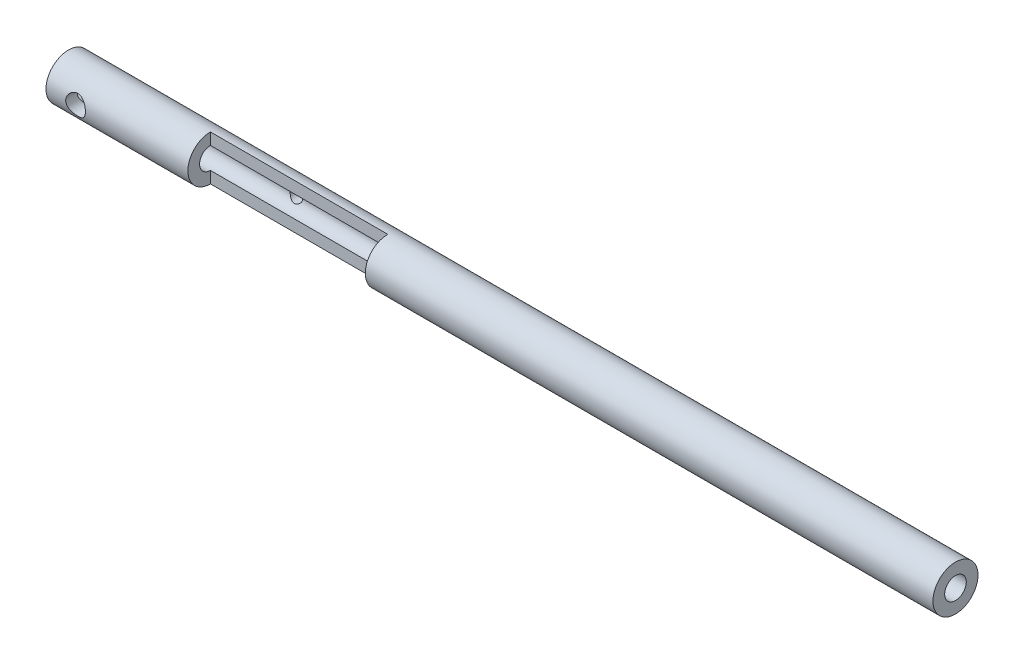
ISO-10303-21;
HEADER;
FILE_DESCRIPTION(('STEP AP214'),'2;1');
FILE_NAME('part.step','',(''),(''),'','','');
FILE_SCHEMA(('AUTOMOTIVE_DESIGN { 1 0 10303 214 1 1 1 1 }'));
ENDSEC;
DATA;
#1=APPLICATION_CONTEXT('core data for automotive mechanical design processes');
#2=APPLICATION_PROTOCOL_DEFINITION('international standard','automotive_design',2000,#1);
#3=PRODUCT_CONTEXT('',#1,'mechanical');
#4=PRODUCT('Part','Part','',(#3));
#5=PRODUCT_RELATED_PRODUCT_CATEGORY('part','',(#4));
#6=PRODUCT_DEFINITION_FORMATION('','',#4);
#7=PRODUCT_DEFINITION_CONTEXT('part definition',#1,'design');
#8=PRODUCT_DEFINITION('design','',#6,#7);
#9=PRODUCT_DEFINITION_SHAPE('','',#8);
#10=(LENGTH_UNIT() NAMED_UNIT(*) SI_UNIT(.MILLI.,.METRE.));
#11=(NAMED_UNIT(*) PLANE_ANGLE_UNIT() SI_UNIT($,.RADIAN.));
#12=(NAMED_UNIT(*) SI_UNIT($,.STERADIAN.) SOLID_ANGLE_UNIT());
#13=UNCERTAINTY_MEASURE_WITH_UNIT(LENGTH_MEASURE(1.E-05),#10,'distance_accuracy_value','');
#14=(GEOMETRIC_REPRESENTATION_CONTEXT(3) GLOBAL_UNCERTAINTY_ASSIGNED_CONTEXT((#13)) GLOBAL_UNIT_ASSIGNED_CONTEXT((#10,
#11,#12)) REPRESENTATION_CONTEXT('',''));
#15=CARTESIAN_POINT('',(0.,0.,0.));
#16=DIRECTION('',(0.,0.,1.));
#17=DIRECTION('',(1.,0.,0.));
#18=AXIS2_PLACEMENT_3D('',#15,#16,#17);
#19=CARTESIAN_POINT('',(125.,0.,0.));
#20=DIRECTION('',(-1.,0.,0.));
#21=DIRECTION('',(0.,0.,1.));
#22=AXIS2_PLACEMENT_3D('',#19,#20,#21);
#23=CYLINDRICAL_SURFACE('',#22,3.175);
#24=CARTESIAN_POINT('',(2.78232389778931,0.,-3.175));
#25=CARTESIAN_POINT('',(2.78233266098721,0.0741002484227452,-3.17499328883161));
#26=CARTESIAN_POINT('',(2.78828642108586,0.148299472937965,-3.17237652187415));
#27=CARTESIAN_POINT('',(2.8118815369405,0.294580240186064,-3.1621603753961));
#28=CARTESIAN_POINT('',(2.82955160528198,0.366656125008927,-3.15454875570767));
#29=CARTESIAN_POINT('',(2.87578784578092,0.506328771138021,-3.13515691619847));
#30=CARTESIAN_POINT('',(2.90431561423495,0.573940344797195,-3.12339139921422));
#31=CARTESIAN_POINT('',(2.97129046653546,0.703346557839349,-3.09682066833734));
#32=CARTESIAN_POINT('',(3.00973510520735,0.76514262601601,-3.08201620393286));
#33=CARTESIAN_POINT('',(3.09764726133812,0.884618048481286,-3.04993281462929));
#34=CARTESIAN_POINT('',(3.14756680396537,0.941941369798854,-3.03256759593424));
#35=CARTESIAN_POINT('',(3.25605315321597,1.04771445081247,-2.99767035314381));
#36=CARTESIAN_POINT('',(3.31462492362141,1.09615908081792,-2.98013823873808));
#37=CARTESIAN_POINT('',(3.44268795149438,1.18546917443488,-2.94579456146462));
#38=CARTESIAN_POINT('',(3.51260505200963,1.22576410582405,-2.92907712978244));
#39=CARTESIAN_POINT('',(3.65905742686315,1.29386286269278,-2.89964313526043));
#40=CARTESIAN_POINT('',(3.73558892060919,1.32167376809972,-2.88692430596705));
#41=CARTESIAN_POINT('',(3.88900181474608,1.36250712592522,-2.86787140706193));
#42=CARTESIAN_POINT('',(3.9656617684621,1.37621806751729,-2.86124198120225));
#43=CARTESIAN_POINT('',(4.12045855027018,1.39060507514491,-2.85427983996626));
#44=CARTESIAN_POINT('',(4.19859440581006,1.39128944442941,-2.85394311357181));
#45=CARTESIAN_POINT('',(4.3469224025084,1.38011859622184,-2.85935712378885));
#46=CARTESIAN_POINT('',(4.41721864390722,1.36933935010344,-2.86458555314038));
#47=CARTESIAN_POINT('',(4.55488047825007,1.33736609275169,-2.87965031057459));
#48=CARTESIAN_POINT('',(4.62224543507238,1.31616983305809,-2.88948763344246));
#49=CARTESIAN_POINT('',(4.75391716957307,1.26354472472517,-2.91288885801366));
#50=CARTESIAN_POINT('',(4.81812287650434,1.23189919119503,-2.92653063013318));
#51=CARTESIAN_POINT('',(4.94057887593984,1.15942892451342,-2.95599007454227));
#52=CARTESIAN_POINT('',(4.99882668180698,1.11860038122587,-2.97180864895153));
#53=CARTESIAN_POINT('',(5.11348504064289,1.02441856648982,-3.00564809683438));
#54=CARTESIAN_POINT('',(5.16920655034242,0.97024810174605,-3.02373611289301));
#55=CARTESIAN_POINT('',(5.27101907866217,0.853172341185042,-3.05883224988505));
#56=CARTESIAN_POINT('',(5.31710735844691,0.790264569691992,-3.07584006275039));
#57=CARTESIAN_POINT('',(5.39950116016502,0.65522148123829,-3.10744978102215));
#58=CARTESIAN_POINT('',(5.43549865938014,0.582878050567121,-3.12197153756001));
#59=CARTESIAN_POINT('',(5.49456556251154,0.432363635808159,-3.14634437170121));
#60=CARTESIAN_POINT('',(5.51764286446223,0.354196245059698,-3.15619830214864));
#61=CARTESIAN_POINT('',(5.54870802870136,0.199986690739896,-3.16957523029787));
#62=CARTESIAN_POINT('',(5.55761887301343,0.124164035325146,-3.17348467421653));
#63=CARTESIAN_POINT('',(5.56288408013387,-0.0279890567748323,-3.17578696731654));
#64=CARTESIAN_POINT('',(5.55924253564506,-0.104319319854722,-3.17418161459636));
#65=CARTESIAN_POINT('',(5.54014144945187,-0.250814192281839,-3.16588123019956));
#66=CARTESIAN_POINT('',(5.52535436611519,-0.321084856214412,-3.15947592332804));
#67=CARTESIAN_POINT('',(5.48534543685702,-0.458056007463564,-3.14254276244027));
#68=CARTESIAN_POINT('',(5.46012230927851,-0.524756055133869,-3.13201440207778));
#69=CARTESIAN_POINT('',(5.39914635076215,-0.655055907248652,-3.10742051676291));
#70=CARTESIAN_POINT('',(5.36308913086486,-0.71849371855782,-3.09325474740912));
#71=CARTESIAN_POINT('',(5.2818005557424,-0.838647330639333,-3.0628651148362));
#72=CARTESIAN_POINT('',(5.23656523404162,-0.895360208268034,-3.04664036293143));
#73=CARTESIAN_POINT('',(5.13407117420484,-1.00513530197654,-3.01228988122864));
#74=CARTESIAN_POINT('',(5.07614809351687,-1.05756335690652,-2.9941148084074));
#75=CARTESIAN_POINT('',(4.95208414115752,-1.15215919311642,-2.95900422795069));
#76=CARTESIAN_POINT('',(4.88594064701715,-1.19432368736687,-2.9420691186395));
#77=CARTESIAN_POINT('',(4.74540883533502,-1.26793460023453,-2.91111677313983));
#78=CARTESIAN_POINT('',(4.67087647999423,-1.29913719439856,-2.89716832435283));
#79=CARTESIAN_POINT('',(4.51680695344611,-1.34825884886714,-2.87464197782401));
#80=CARTESIAN_POINT('',(4.43727456263499,-1.36619039385885,-2.86605903368886));
#81=CARTESIAN_POINT('',(4.28256606140743,-1.38696245290779,-2.85606037766611));
#82=CARTESIAN_POINT('',(4.20757566889892,-1.39093115688441,-2.85410930932235));
#83=CARTESIAN_POINT('',(4.05802539986159,-1.3867393153146,-2.85614871877768));
#84=CARTESIAN_POINT('',(3.9834654416912,-1.37858115122035,-2.86013803001614));
#85=CARTESIAN_POINT('',(3.84126644202479,-1.35134547482805,-2.87309861965751));
#86=CARTESIAN_POINT('',(3.77347449593487,-1.33291183615757,-2.88177527482477));
#87=CARTESIAN_POINT('',(3.64194754046999,-1.28631506699533,-2.90287254754317));
#88=CARTESIAN_POINT('',(3.57821370146993,-1.2581491445897,-2.91529423930773));
#89=CARTESIAN_POINT('',(3.45220275307444,-1.19084660443423,-2.94345343055338));
#90=CARTESIAN_POINT('',(3.39027247199824,-1.15112898850492,-2.95935090959487));
#91=CARTESIAN_POINT('',(3.27360453455463,-1.06261974826519,-2.99227210678041));
#92=CARTESIAN_POINT('',(3.2188697773005,-1.01382448553094,-3.00929627474526));
#93=CARTESIAN_POINT('',(3.1134179230009,-0.90371044573717,-3.04426305033888));
#94=CARTESIAN_POINT('',(3.06342077087854,-0.841685224971104,-3.06216323425266));
#95=CARTESIAN_POINT('',(2.97447858084212,-0.709487863298918,-3.09546309796954));
#96=CARTESIAN_POINT('',(2.93553856483538,-0.639312040891855,-3.11086164022807));
#97=CARTESIAN_POINT('',(2.8705257530211,-0.493558744188367,-3.13726645261984));
#98=CARTESIAN_POINT('',(2.84429449502362,-0.418061994584942,-3.14832646866616));
#99=CARTESIAN_POINT('',(2.80517525202342,-0.263264010711841,-3.16501615924716));
#100=CARTESIAN_POINT('',(2.79224628294782,-0.183975254387443,-3.17066250948811));
#101=CARTESIAN_POINT('',(2.78362505407908,-0.0695297729691255,-3.17443143617446));
#102=CARTESIAN_POINT('',(2.78231978515672,-0.0347757861933457,-3.1750031496002));
#103=CARTESIAN_POINT('',(2.78232389778931,0.,-3.175));
#104=B_SPLINE_CURVE_WITH_KNOTS('',3,(#24,#25,#26,#27,#28,#29,#30,#31,#32,#33,#34,#35,#36,#37,
#38,#39,#40,#41,#42,#43,#44,#45,#46,#47,#48,#49,#50,#51,#52,#53,#54,#55,#56,#57,#58,#59,#60,#61,
#62,#63,#64,#65,#66,#67,#68,#69,#70,#71,#72,#73,#74,#75,#76,#77,#78,#79,#80,#81,#82,#83,#84,#85,
#86,#87,#88,#89,#90,#91,#92,#93,#94,#95,#96,#97,#98,#99,#100,#101,#102,#103),.UNSPECIFIED.,.T.,
.F.,(4,2,2,2,2,2,2,2,2,2,2,2,2,2,2,2,2,2,2,2,2,2,2,2,2,2,2,2,2,2,2,2,2,2,2,2,2,2,2,4),(0.,
0.222194541506917,0.444935626886108,0.666896090011031,0.888801877199572,1.12171020083249,
1.3547526666487,1.60074098249339,1.84658961691403,2.07976373974892,2.31278923041657,
2.52572521941807,2.73870718978642,2.95641662136562,3.17421655026827,3.41251799465274,
3.65088709893281,3.89589142039968,4.14074580829783,4.36887610060082,4.5969320181234,
4.81223115585247,5.02755674245295,5.24961047658798,5.4717603802783,5.71131550211373,
5.95094724373159,6.19561413611927,6.44005056549774,6.66421562234535,6.88833666388418,
7.09977806852577,7.311280180087,7.53615355471895,7.76111725610138,8.00491403789003,
8.24882137033704,8.48960377714532,8.72964209657236,8.83391961295382),.UNSPECIFIED.);
#105=CARTESIAN_POINT('',(2.78232389778931,0.,-3.175));
#106=VERTEX_POINT('',#105);
#107=EDGE_CURVE('E104',#106,#106,#104,.T.);
#108=ORIENTED_EDGE('',*,*,#107,.F.);
#109=EDGE_LOOP('',(#108));
#110=FACE_BOUND('',#109,.T.);
#111=CARTESIAN_POINT('',(125.,0.,0.));
#112=DIRECTION('',(1.,0.,0.));
#113=DIRECTION('',(0.,0.,-1.));
#114=AXIS2_PLACEMENT_3D('',#111,#112,#113);
#115=CIRCLE('',#114,3.175);
#116=CARTESIAN_POINT('',(125.,0.,-3.175));
#117=VERTEX_POINT('',#116);
#118=EDGE_CURVE('E139',#117,#117,#115,.T.);
#119=ORIENTED_EDGE('',*,*,#118,.F.);
#120=EDGE_LOOP('',(#119));
#121=FACE_BOUND('',#120,.T.);
#122=CARTESIAN_POINT('',(0.,0.,0.));
#123=DIRECTION('',(1.,0.,0.));
#124=DIRECTION('',(0.,0.,-1.));
#125=AXIS2_PLACEMENT_3D('',#122,#123,#124);
#126=CIRCLE('',#125,3.175);
#127=CARTESIAN_POINT('',(0.,0.,-3.175));
#128=VERTEX_POINT('',#127);
#129=EDGE_CURVE('E182',#128,#128,#126,.T.);
#130=ORIENTED_EDGE('',*,*,#129,.T.);
#131=EDGE_LOOP('',(#130));
#132=FACE_BOUND('',#131,.T.);
#133=CARTESIAN_POINT('',(5.56108389778931,0.,3.175));
#134=CARTESIAN_POINT('',(5.56107513459142,0.0741002484227452,3.17499328883161));
#135=CARTESIAN_POINT('',(5.55512137449276,0.148299472937965,3.17237652187415));
#136=CARTESIAN_POINT('',(5.53152625863813,0.294580240186064,3.1621603753961));
#137=CARTESIAN_POINT('',(5.51385619029665,0.366656125008927,3.15454875570767));
#138=CARTESIAN_POINT('',(5.46761994979771,0.506328771138021,3.13515691619847));
#139=CARTESIAN_POINT('',(5.43909218134368,0.573940344797195,3.12339139921422));
#140=CARTESIAN_POINT('',(5.37211732904317,0.70334655783935,3.09682066833734));
#141=CARTESIAN_POINT('',(5.33367269037127,0.76514262601601,3.08201620393286));
#142=CARTESIAN_POINT('',(5.24576053424051,0.884618048481286,3.04993281462929));
#143=CARTESIAN_POINT('',(5.19584099161326,0.941941369798855,3.03256759593424));
#144=CARTESIAN_POINT('',(5.08735464236266,1.04771445081247,2.99767035314381));
#145=CARTESIAN_POINT('',(5.02878287195722,1.09615908081792,2.98013823873808));
#146=CARTESIAN_POINT('',(4.90071984408425,1.18546917443488,2.94579456146462));
#147=CARTESIAN_POINT('',(4.830802743569,1.22576410582405,2.92907712978244));
#148=CARTESIAN_POINT('',(4.68435036871548,1.29386286269278,2.89964313526043));
#149=CARTESIAN_POINT('',(4.60781887496944,1.32167376809972,2.88692430596705));
#150=CARTESIAN_POINT('',(4.45440598083255,1.36250712592522,2.86787140706193));
#151=CARTESIAN_POINT('',(4.37774602711653,1.37621806751729,2.86124198120225));
#152=CARTESIAN_POINT('',(4.22294924530845,1.39060507514491,2.85427983996626));
#153=CARTESIAN_POINT('',(4.14481338976857,1.39128944442941,2.85394311357181));
#154=CARTESIAN_POINT('',(3.99648539307023,1.38011859622184,2.85935712378885));
#155=CARTESIAN_POINT('',(3.92618915167141,1.36933935010344,2.86458555314038));
#156=CARTESIAN_POINT('',(3.78852731732856,1.33736609275169,2.87965031057459));
#157=CARTESIAN_POINT('',(3.72116236050625,1.31616983305809,2.88948763344246));
#158=CARTESIAN_POINT('',(3.58949062600555,1.26354472472517,2.91288885801366));
#159=CARTESIAN_POINT('',(3.52528491907428,1.23189919119503,2.92653063013318));
#160=CARTESIAN_POINT('',(3.40282891963878,1.15942892451342,2.95599007454227));
#161=CARTESIAN_POINT('',(3.34458111377164,1.11860038122587,2.97180864895153));
#162=CARTESIAN_POINT('',(3.22992275493574,1.02441856648982,3.00564809683438));
#163=CARTESIAN_POINT('',(3.17420124523621,0.970248101746049,3.02373611289301));
#164=CARTESIAN_POINT('',(3.07238871691645,0.853172341185042,3.05883224988505));
#165=CARTESIAN_POINT('',(3.02630043713172,0.790264569691991,3.07584006275039));
#166=CARTESIAN_POINT('',(2.9439066354136,0.655221481238289,3.10744978102215));
#167=CARTESIAN_POINT('',(2.90790913619849,0.58287805056712,3.12197153756001));
#168=CARTESIAN_POINT('',(2.84884223306708,0.432363635808158,3.14634437170121));
#169=CARTESIAN_POINT('',(2.82576493111639,0.354196245059697,3.15619830214864));
#170=CARTESIAN_POINT('',(2.79469976687727,0.199986690739895,3.16957523029787));
#171=CARTESIAN_POINT('',(2.7857889225652,0.124164035325145,3.17348467421653));
#172=CARTESIAN_POINT('',(2.78052371544476,-0.0279890567748328,3.17578696731654));
#173=CARTESIAN_POINT('',(2.78416525993357,-0.104319319854722,3.17418161459636));
#174=CARTESIAN_POINT('',(2.80326634612676,-0.250814192281839,3.16588123019956));
#175=CARTESIAN_POINT('',(2.81805342946343,-0.321084856214413,3.15947592332804));
#176=CARTESIAN_POINT('',(2.85806235872161,-0.458056007463564,3.14254276244027));
#177=CARTESIAN_POINT('',(2.88328548630012,-0.524756055133869,3.13201440207778));
#178=CARTESIAN_POINT('',(2.94426144481648,-0.655055907248652,3.10742051676291));
#179=CARTESIAN_POINT('',(2.98031866471377,-0.71849371855782,3.09325474740912));
#180=CARTESIAN_POINT('',(3.06160723983622,-0.838647330639334,3.0628651148362));
#181=CARTESIAN_POINT('',(3.10684256153701,-0.895360208268034,3.04664036293143));
#182=CARTESIAN_POINT('',(3.20933662137379,-1.00513530197654,3.01228988122864));
#183=CARTESIAN_POINT('',(3.26725970206176,-1.05756335690652,2.9941148084074));
#184=CARTESIAN_POINT('',(3.39132365442111,-1.15215919311642,2.95900422795069));
#185=CARTESIAN_POINT('',(3.45746714856148,-1.19432368736687,2.9420691186395));
#186=CARTESIAN_POINT('',(3.59799896024361,-1.26793460023453,2.91111677313983));
#187=CARTESIAN_POINT('',(3.67253131558439,-1.29913719439856,2.89716832435283));
#188=CARTESIAN_POINT('',(3.82660084213251,-1.34825884886714,2.87464197782401));
#189=CARTESIAN_POINT('',(3.90613323294364,-1.36619039385885,2.86605903368886));
#190=CARTESIAN_POINT('',(4.06084173417119,-1.38696245290779,2.85606037766611));
#191=CARTESIAN_POINT('',(4.13583212667971,-1.39093115688441,2.85410930932235));
#192=CARTESIAN_POINT('',(4.28538239571703,-1.3867393153146,2.85614871877768));
#193=CARTESIAN_POINT('',(4.35994235388743,-1.37858115122035,2.86013803001614));
#194=CARTESIAN_POINT('',(4.50214135355384,-1.35134547482805,2.87309861965751));
#195=CARTESIAN_POINT('',(4.56993329964375,-1.33291183615757,2.88177527482477));
#196=CARTESIAN_POINT('',(4.70146025510864,-1.28631506699533,2.90287254754317));
#197=CARTESIAN_POINT('',(4.7651940941087,-1.2581491445897,2.91529423930773));
#198=CARTESIAN_POINT('',(4.89120504250419,-1.19084660443423,2.94345343055338));
#199=CARTESIAN_POINT('',(4.95313532358038,-1.15112898850492,2.95935090959487));
#200=CARTESIAN_POINT('',(5.069803261024,-1.06261974826519,2.99227210678041));
#201=CARTESIAN_POINT('',(5.12453801827813,-1.01382448553094,3.00929627474526));
#202=CARTESIAN_POINT('',(5.22998987257773,-0.90371044573717,3.04426305033888));
#203=CARTESIAN_POINT('',(5.27998702470009,-0.841685224971103,3.06216323425266));
#204=CARTESIAN_POINT('',(5.3689292147365,-0.709487863298918,3.09546309796954));
#205=CARTESIAN_POINT('',(5.40786923074325,-0.639312040891855,3.11086164022807));
#206=CARTESIAN_POINT('',(5.47288204255753,-0.493558744188367,3.13726645261984));
#207=CARTESIAN_POINT('',(5.49911330055501,-0.418061994584942,3.14832646866616));
#208=CARTESIAN_POINT('',(5.53823254355521,-0.26326401071184,3.16501615924716));
#209=CARTESIAN_POINT('',(5.55116151263081,-0.183975254387442,3.17066250948811));
#210=CARTESIAN_POINT('',(5.55978274149955,-0.0695297729691252,3.17443143617446));
#211=CARTESIAN_POINT('',(5.5610880104219,-0.0347757861933455,3.1750031496002));
#212=CARTESIAN_POINT('',(5.56108389778931,0.,3.175));
#213=B_SPLINE_CURVE_WITH_KNOTS('',3,(#133,#134,#135,#136,#137,#138,#139,#140,#141,#142,#143,
#144,#145,#146,#147,#148,#149,#150,#151,#152,#153,#154,#155,#156,#157,#158,#159,#160,#161,#162,
#163,#164,#165,#166,#167,#168,#169,#170,#171,#172,#173,#174,#175,#176,#177,#178,#179,#180,#181,
#182,#183,#184,#185,#186,#187,#188,#189,#190,#191,#192,#193,#194,#195,#196,#197,#198,#199,#200,
#201,#202,#203,#204,#205,#206,#207,#208,#209,#210,#211,#212),.UNSPECIFIED.,.T.,.F.,(4,2,2,2,2,2,
2,2,2,2,2,2,2,2,2,2,2,2,2,2,2,2,2,2,2,2,2,2,2,2,2,2,2,2,2,2,2,2,2,4),(0.,0.222194541506917,
0.444935626886108,0.666896090011032,0.888801877199573,1.12171020083249,1.3547526666487,
1.60074098249339,1.84658961691403,2.07976373974892,2.31278923041657,2.52572521941807,
2.73870718978642,2.95641662136562,3.17421655026827,3.41251799465274,3.65088709893281,
3.89589142039969,4.14074580829783,4.36887610060083,4.5969320181234,4.81223115585247,
5.02755674245295,5.24961047658798,5.4717603802783,5.71131550211374,5.95094724373159,
6.19561413611927,6.44005056549774,6.66421562234535,6.88833666388418,7.09977806852577,
7.311280180087,7.53615355471895,7.76111725610138,8.00491403789003,8.24882137033704,
8.48960377714532,8.72964209657236,8.83391961295382),.UNSPECIFIED.);
#214=CARTESIAN_POINT('',(5.56108389778931,0.,3.175));
#215=VERTEX_POINT('',#214);
#216=EDGE_CURVE('E110',#215,#215,#213,.T.);
#217=ORIENTED_EDGE('',*,*,#216,.F.);
#218=EDGE_LOOP('',(#217));
#219=FACE_BOUND('',#218,.T.);
#220=DIRECTION('',(-1.,0.,0.));
#221=VECTOR('',#220,1.);
#222=CARTESIAN_POINT('',(125.,3.175,0.));
#223=LINE('',#222,#221);
#224=CARTESIAN_POINT('',(45.,3.175,0.));
#225=VERTEX_POINT('',#224);
#226=CARTESIAN_POINT('',(20.,3.175,0.));
#227=VERTEX_POINT('',#226);
#228=EDGE_CURVE('E82',#225,#227,#223,.T.);
#229=ORIENTED_EDGE('',*,*,#228,.F.);
#230=CARTESIAN_POINT('',(45.,0.,0.));
#231=DIRECTION('',(-1.,0.,0.));
#232=DIRECTION('',(0.,-1.,0.));
#233=AXIS2_PLACEMENT_3D('',#230,#231,#232);
#234=CIRCLE('',#233,3.175);
#235=CARTESIAN_POINT('',(45.,-3.175,0.));
#236=VERTEX_POINT('',#235);
#237=EDGE_CURVE('E89',#236,#225,#234,.T.);
#238=ORIENTED_EDGE('',*,*,#237,.F.);
#239=DIRECTION('',(-1.,0.,0.));
#240=VECTOR('',#239,1.);
#241=CARTESIAN_POINT('',(125.,-3.175,0.));
#242=LINE('',#241,#240);
#243=CARTESIAN_POINT('',(20.,-3.175,0.));
#244=VERTEX_POINT('',#243);
#245=EDGE_CURVE('E90',#244,#236,#242,.F.);
#246=ORIENTED_EDGE('',*,*,#245,.F.);
#247=CARTESIAN_POINT('',(20.,0.,0.));
#248=DIRECTION('',(1.,0.,0.));
#249=DIRECTION('',(0.,0.,-1.));
#250=AXIS2_PLACEMENT_3D('',#247,#248,#249);
#251=CIRCLE('',#250,3.175);
#252=EDGE_CURVE('E53',#227,#244,#251,.T.);
#253=ORIENTED_EDGE('',*,*,#252,.F.);
#254=EDGE_LOOP('',(#229,#238,#246,#253));
#255=FACE_BOUND('',#254,.T.);
#256=ADVANCED_FACE('F33',(#110,#121,#132,#219,#255),#23,.T.);
#257=CARTESIAN_POINT('',(125.,0.,0.));
#258=DIRECTION('',(-1.,0.,0.));
#259=DIRECTION('',(0.,0.,1.));
#260=AXIS2_PLACEMENT_3D('',#257,#258,#259);
#261=CYLINDRICAL_SURFACE('',#260,1.524);
#262=CARTESIAN_POINT('',(31.4853642001537,0.,-1.524));
#263=CARTESIAN_POINT('',(31.4853587492534,0.0456791883621158,-1.52399521890479));
#264=CARTESIAN_POINT('',(31.4818178572754,0.0914385614800972,-1.52192276282072));
#265=CARTESIAN_POINT('',(31.4678209766588,0.181599504098324,-1.51382332051734));
#266=CARTESIAN_POINT('',(31.4573456494765,0.225996912050766,-1.50778527555523));
#267=CARTESIAN_POINT('',(31.430058107127,0.311924543097764,-1.49237214662888));
#268=CARTESIAN_POINT('',(31.413277172097,0.35346774105905,-1.48301354745973));
#269=CARTESIAN_POINT('',(31.3740394325576,0.433026033196919,-1.46176684184275));
#270=CARTESIAN_POINT('',(31.3515845662408,0.471042326099841,-1.44987959938832));
#271=CARTESIAN_POINT('',(31.2997784861939,0.545657995245621,-1.42355604113326));
#272=CARTESIAN_POINT('',(31.2700396543157,0.581943846677991,-1.40899613293582));
#273=CARTESIAN_POINT('',(31.2053716613962,0.649319141293396,-1.37924622798589));
#274=CARTESIAN_POINT('',(31.1704360720781,0.680402045877371,-1.36405546790071));
#275=CARTESIAN_POINT('',(31.0916493966547,0.740086687610023,-1.33270716273444));
#276=CARTESIAN_POINT('',(31.0472356126565,0.767997997063308,-1.31663776921029));
#277=CARTESIAN_POINT('',(30.9534064155119,0.815845303223865,-1.28754048632174));
#278=CARTESIAN_POINT('',(30.9039989919889,0.835793794700697,-1.27450784535475));
#279=CARTESIAN_POINT('',(30.8131843544445,0.863141777962856,-1.25609279596824));
#280=CARTESIAN_POINT('',(30.7725456480223,0.872371093473501,-1.24964083585348));
#281=CARTESIAN_POINT('',(30.6899659368076,0.885042074518663,-1.24070109870262));
#282=CARTESIAN_POINT('',(30.648026472202,0.888490337357886,-1.23820880309004));
#283=CARTESIAN_POINT('',(30.5639811464907,0.889405136779253,-1.23755202616455));
#284=CARTESIAN_POINT('',(30.5218751267048,0.886862128699425,-1.23939445046452));
#285=CARTESIAN_POINT('',(30.4388039192696,0.875930286925426,-1.24714267902103));
#286=CARTESIAN_POINT('',(30.3978395693721,0.867537272182619,-1.25305138944796));
#287=CARTESIAN_POINT('',(30.3183637766508,0.845415714559744,-1.2680785383861));
#288=CARTESIAN_POINT('',(30.2798365006378,0.831726892318378,-1.27717303533652));
#289=CARTESIAN_POINT('',(30.205512850283,0.799499297407453,-1.29759008370735));
#290=CARTESIAN_POINT('',(30.1697175096961,0.780958700480959,-1.30891347278878));
#291=CARTESIAN_POINT('',(30.0955477530116,0.735992364499967,-1.33479204445614));
#292=CARTESIAN_POINT('',(30.0577353192692,0.708767906766329,-1.34957146433983));
#293=CARTESIAN_POINT('',(29.9868408647357,0.648814684494342,-1.37939784898785));
#294=CARTESIAN_POINT('',(29.9537631397072,0.616080979306509,-1.39444504296099));
#295=CARTESIAN_POINT('',(29.8891347988955,0.541189355765053,-1.42531579359815));
#296=CARTESIAN_POINT('',(29.858282421315,0.498366111735729,-1.44100417049213));
#297=CARTESIAN_POINT('',(29.8043253038627,0.40718053299781,-1.46937197025766));
#298=CARTESIAN_POINT('',(29.7812159301469,0.358821534526845,-1.48205319144545));
#299=CARTESIAN_POINT('',(29.7451327203437,0.261239559953916,-1.50221227061842));
#300=CARTESIAN_POINT('',(29.7315830024849,0.212292116409951,-1.50998209611813));
#301=CARTESIAN_POINT('',(29.7130264483083,0.11230633280896,-1.52068447528833));
#302=CARTESIAN_POINT('',(29.7080104663883,0.0612702912690156,-1.52362220739948));
#303=CARTESIAN_POINT('',(29.7069094286189,-0.0344004412273912,-1.52426598639669));
#304=CARTESIAN_POINT('',(29.7097687836403,-0.0790229980947584,-1.52259040107872));
#305=CARTESIAN_POINT('',(29.7220680745626,-0.16703589117524,-1.51546144560317));
#306=CARTESIAN_POINT('',(29.7315080322572,-0.210426223306941,-1.51000806293417));
#307=CARTESIAN_POINT('',(29.7563187665156,-0.294147794781267,-1.49593761523006));
#308=CARTESIAN_POINT('',(29.7715937412667,-0.334516464826714,-1.48737175759696));
#309=CARTESIAN_POINT('',(29.8075045586981,-0.412130640592766,-1.46776311258914));
#310=CARTESIAN_POINT('',(29.8281415897835,-0.449375451541449,-1.45671977619915));
#311=CARTESIAN_POINT('',(29.8766061175415,-0.523875278268968,-1.43172307920672));
#312=CARTESIAN_POINT('',(29.904959075657,-0.560726202889769,-1.41758633882419));
#313=CARTESIAN_POINT('',(29.9668579885201,-0.629432294443532,-1.38844765232992));
#314=CARTESIAN_POINT('',(30.0004099792978,-0.66128156684984,-1.37344471343564));
#315=CARTESIAN_POINT('',(30.0764569649456,-0.722975599430055,-1.34209407838026));
#316=CARTESIAN_POINT('',(30.1195415307256,-0.752125872194959,-1.32579996035113));
#317=CARTESIAN_POINT('',(30.2108177834865,-0.802738616352687,-1.2957836101968));
#318=CARTESIAN_POINT('',(30.2590030775547,-0.824210566793759,-1.28205821697993));
#319=CARTESIAN_POINT('',(30.3485993400657,-0.854789829386789,-1.26181292980745));
#320=CARTESIAN_POINT('',(30.3892328427722,-0.8655644684798,-1.25437769872517));
#321=CARTESIAN_POINT('',(30.4721050980492,-0.88127965005088,-1.24338922770281));
#322=CARTESIAN_POINT('',(30.5143417857671,-0.886227450622916,-1.23983115866116));
#323=CARTESIAN_POINT('',(30.599349516787,-0.890014973076948,-1.23711592550119));
#324=CARTESIAN_POINT('',(30.6421216876423,-0.888838312844351,-1.23797056473918));
#325=CARTESIAN_POINT('',(30.7267647111345,-0.880413608738434,-1.24397456673289));
#326=CARTESIAN_POINT('',(30.7686349985403,-0.873161864869856,-1.24912654675139));
#327=CARTESIAN_POINT('',(30.8491351651832,-0.853286766152974,-1.26278098184871));
#328=CARTESIAN_POINT('',(30.887824099922,-0.840827444914442,-1.27118058053149));
#329=CARTESIAN_POINT('',(30.9626319128649,-0.811043733251497,-1.29038644223339));
#330=CARTESIAN_POINT('',(30.9987498114765,-0.793717500786125,-1.30119361615665));
#331=CARTESIAN_POINT('',(31.0733647958762,-0.751598626208703,-1.32603191388773));
#332=CARTESIAN_POINT('',(31.1113634482022,-0.726065078194,-1.34030311505678));
#333=CARTESIAN_POINT('',(31.1829064303617,-0.669603354858001,-1.36938572827002));
#334=CARTESIAN_POINT('',(31.2164472327077,-0.638670951676836,-1.38419755643758));
#335=CARTESIAN_POINT('',(31.282919926395,-0.567156436367274,-1.41514341113992));
#336=CARTESIAN_POINT('',(31.3151075318628,-0.525829479013966,-1.43117177056137));
#337=CARTESIAN_POINT('',(31.3720674441779,-0.437453153598652,-1.46060805710158));
#338=CARTESIAN_POINT('',(31.3968380114863,-0.390402446762422,-1.47401536924316));
#339=CARTESIAN_POINT('',(31.4368491494643,-0.29410077899765,-1.49613024352886));
#340=CARTESIAN_POINT('',(31.4524860208763,-0.245060037390231,-1.50503056177214));
#341=CARTESIAN_POINT('',(31.4750404003338,-0.144503778149984,-1.51797195231991));
#342=CARTESIAN_POINT('',(31.4819916857593,-0.0929986612770729,-1.52203184571372));
#343=CARTESIAN_POINT('',(31.485045586134,-0.0275596976941883,-1.52381462255901));
#344=CARTESIAN_POINT('',(31.4853658449395,-0.0137834992771697,-1.52400144267498));
#345=CARTESIAN_POINT('',(31.4853642001537,0.,-1.524));
#346=B_SPLINE_CURVE_WITH_KNOTS('',3,(#262,#263,#264,#265,#266,#267,#268,#269,#270,#271,#272,
#273,#274,#275,#276,#277,#278,#279,#280,#281,#282,#283,#284,#285,#286,#287,#288,#289,#290,#291,
#292,#293,#294,#295,#296,#297,#298,#299,#300,#301,#302,#303,#304,#305,#306,#307,#308,#309,#310,
#311,#312,#313,#314,#315,#316,#317,#318,#319,#320,#321,#322,#323,#324,#325,#326,#327,#328,#329,
#330,#331,#332,#333,#334,#335,#336,#337,#338,#339,#340,#341,#342,#343,#344,#345),.UNSPECIFIED.,
.T.,.F.,(4,2,2,2,2,2,2,2,2,2,2,2,2,2,2,2,2,2,2,2,2,2,2,2,2,2,2,2,2,2,2,2,2,2,2,2,2,2,2,2,2,4),
(0.,0.136998887041747,0.274381451107333,0.411091312662455,0.547754537653491,0.694540456936765,
0.841509480817745,1.0052885278379,1.16880956285988,1.29477741847513,1.42060142218572,
1.5466260109601,1.67274076304258,1.79792739128247,1.92316115722899,2.06923388578249,
2.21543831609889,2.3797762057123,2.54401556999621,2.69723832346458,2.8502967644766,
2.98387151222842,3.11744670235901,3.24891701700785,3.38041649462398,3.52563116808051,
3.67101571541438,3.83377572112124,3.99633409685509,4.12386583847953,4.25123855394834,
4.37895214922043,4.50674358433076,4.63078147500185,4.75486637525202,4.89817704446104,
5.04160044839036,5.20512661663885,5.36869110715736,5.52449734682803,5.67969576637916,
5.72103459327651),.UNSPECIFIED.);
#347=CARTESIAN_POINT('',(31.4853642001537,0.,-1.524));
#348=VERTEX_POINT('',#347);
#349=EDGE_CURVE('E37',#348,#348,#346,.T.);
#350=ORIENTED_EDGE('',*,*,#349,.F.);
#351=EDGE_LOOP('',(#350));
#352=FACE_BOUND('',#351,.T.);
#353=CARTESIAN_POINT('',(5.56108389778931,0.,1.524));
#354=CARTESIAN_POINT('',(5.56108167350128,0.0641317775010188,1.52399780146347));
#355=CARTESIAN_POINT('',(5.55660983152747,0.128279156115402,1.51991778216249));
#356=CARTESIAN_POINT('',(5.53908212741377,0.254394379362222,1.50396465259137));
#357=CARTESIAN_POINT('',(5.52602026026222,0.316360667314929,1.49208609061955));
#358=CARTESIAN_POINT('',(5.49236453130318,0.435972576120146,1.46160630889522));
#359=CARTESIAN_POINT('',(5.47181845209464,0.493642871505347,1.44304774602249));
#360=CARTESIAN_POINT('',(5.42434129868722,0.604065923488641,1.40042537819112));
#361=CARTESIAN_POINT('',(5.39740747854896,0.656816551612785,1.37635920579722));
#362=CARTESIAN_POINT('',(5.326411659971,0.776951233286386,1.3134588963005));
#363=CARTESIAN_POINT('',(5.2798068755114,0.841754337922037,1.27256722098223));
#364=CARTESIAN_POINT('',(5.17853364215058,0.960623769226657,1.18542734220196));
#365=CARTESIAN_POINT('',(5.12384587801188,1.01466362889141,1.13916636664834));
#366=CARTESIAN_POINT('',(5.00637266370571,1.11343841546111,1.04291686660068));
#367=CARTESIAN_POINT('',(4.94342336959512,1.15791671780342,0.99286525302834));
#368=CARTESIAN_POINT('',(4.84392215536178,1.21654121982236,0.918479827797016));
#369=CARTESIAN_POINT('',(4.80992873969992,1.23472620009659,0.893813247706679));
#370=CARTESIAN_POINT('',(4.74006107016699,1.26840523528787,0.845335115625762));
#371=CARTESIAN_POINT('',(4.70418790865111,1.28390083096581,0.821523080306939));
#372=CARTESIAN_POINT('',(4.63089684920664,1.31188119905962,0.77604378103235));
#373=CARTESIAN_POINT('',(4.59351522678612,1.32441235985756,0.754347108492496));
#374=CARTESIAN_POINT('',(4.51625910465725,1.3465779940946,0.71402427866674));
#375=CARTESIAN_POINT('',(4.47638545584952,1.3562134498131,0.695397081125961));
#376=CARTESIAN_POINT('',(4.40084041574681,1.37079900423271,0.666114988063524));
#377=CARTESIAN_POINT('',(4.36559699421189,1.37626562519759,0.654644907927992));
#378=CARTESIAN_POINT('',(4.29353833801496,1.38449936128342,0.637051911176401));
#379=CARTESIAN_POINT('',(4.25672867894697,1.38727533234135,0.630911459779171));
#380=CARTESIAN_POINT('',(4.18212628267713,1.38984493936637,0.625236246528928));
#381=CARTESIAN_POINT('',(4.14432768639711,1.38961157592607,0.625761286052139));
#382=CARTESIAN_POINT('',(4.06952609123205,1.38612669090837,0.633437291450764));
#383=CARTESIAN_POINT('',(4.03252500632703,1.38286859103227,0.640602698961816));
#384=CARTESIAN_POINT('',(3.94851371154358,1.37218869608098,0.663227020053224));
#385=CARTESIAN_POINT('',(3.90218379361702,1.36375421882048,0.680630902538554));
#386=CARTESIAN_POINT('',(3.81275223880028,1.34300223251156,0.720716133671226));
#387=CARTESIAN_POINT('',(3.76966459293429,1.33066896990578,0.743418793591488));
#388=CARTESIAN_POINT('',(3.68721809824776,1.30288024881879,0.791091800926235));
#389=CARTESIAN_POINT('',(3.64779834530254,1.28749890032099,0.816001758982075));
#390=CARTESIAN_POINT('',(3.57122082947555,1.25361451013754,0.867163902231332));
#391=CARTESIAN_POINT('',(3.53406497538228,1.23510888248171,0.893417186649265));
#392=CARTESIAN_POINT('',(3.42554141880283,1.17493931135009,0.972878267128964));
#393=CARTESIAN_POINT('',(3.35716511215992,1.12863905905987,1.02675708932191));
#394=CARTESIAN_POINT('',(3.22423032193831,1.02004590485167,1.13506734479486));
#395=CARTESIAN_POINT('',(3.16019871608894,0.956917146909055,1.18931221137347));
#396=CARTESIAN_POINT('',(3.04342863834221,0.815890587344142,1.29009439964564));
#397=CARTESIAN_POINT('',(2.99064701545873,0.738051460684965,1.33666101082633));
#398=CARTESIAN_POINT('',(2.91716036780894,0.600099790907551,1.40211242621879));
#399=CARTESIAN_POINT('',(2.89184276582628,0.544251824747637,1.42483552761531));
#400=CARTESIAN_POINT('',(2.84835091449894,0.427747878446803,1.46402594263883));
#401=CARTESIAN_POINT('',(2.83017138166513,0.367095494576854,1.48049788297585));
#402=CARTESIAN_POINT('',(2.80203218836128,0.241902802829796,1.50604279403875));
#403=CARTESIAN_POINT('',(2.79213091919814,0.177338265293075,1.51506319960134));
#404=CARTESIAN_POINT('',(2.78157431222674,0.046837672797343,1.52468171681272));
#405=CARTESIAN_POINT('',(2.78091457268504,-0.0190977142385832,1.52528383808358));
#406=CARTESIAN_POINT('',(2.78845789711014,-0.143015110742996,1.518409424476));
#407=CARTESIAN_POINT('',(2.7957375141048,-0.201105201932901,1.51177462516759));
#408=CARTESIAN_POINT('',(2.81723654749832,-0.314878094812945,1.49223357024862));
#409=CARTESIAN_POINT('',(2.8314570438325,-0.370560520424933,1.47932633870817));
#410=CARTESIAN_POINT('',(2.86654228035846,-0.479924108537569,1.44761451803772));
#411=CARTESIAN_POINT('',(2.88758991717714,-0.533498442720467,1.42864783801901));
#412=CARTESIAN_POINT('',(2.93519471374003,-0.636102345801245,1.38601697348654));
#413=CARTESIAN_POINT('',(2.96175432765914,-0.685129876144914,1.3623506967086));
#414=CARTESIAN_POINT('',(3.03414783856333,-0.801981248277703,1.29838741687711));
#415=CARTESIAN_POINT('',(3.08292122874796,-0.86671038165097,1.25574726708322));
#416=CARTESIAN_POINT('',(3.18863396442492,-0.985027744384946,1.16527938774136));
#417=CARTESIAN_POINT('',(3.24559690936552,-1.03858264081358,1.11743676705439));
#418=CARTESIAN_POINT('',(3.3678401989958,-1.13597767618527,1.0183517686124));
#419=CARTESIAN_POINT('',(3.4332873139231,-1.17955389407659,0.967055361291273));
#420=CARTESIAN_POINT('',(3.5368547992502,-1.23648057642708,0.891455752769805));
#421=CARTESIAN_POINT('',(3.57224965134114,-1.2540403576347,0.866497340009521));
#422=CARTESIAN_POINT('',(3.64509011546651,-1.28632928657467,0.817790663374275));
#423=CARTESIAN_POINT('',(3.68253408753628,-1.30106065658723,0.79404146029509));
#424=CARTESIAN_POINT('',(3.75654351945791,-1.32642980283829,0.75082190010596));
#425=CARTESIAN_POINT('',(3.79291182078603,-1.33730947532136,0.731159373315469));
#426=CARTESIAN_POINT('',(3.86800098369202,-1.35633261851953,0.69523337517707));
#427=CARTESIAN_POINT('',(3.906719421624,-1.36447885340252,0.678966476357145));
#428=CARTESIAN_POINT('',(3.9799646965948,-1.3764985781364,0.654207129130872));
#429=CARTESIAN_POINT('',(4.01411504640261,-1.38085783190998,0.64487091200707));
#430=CARTESIAN_POINT('',(4.08363174353109,-1.38702183366901,0.631509179791845));
#431=CARTESIAN_POINT('',(4.1189945616577,-1.38883344169975,0.627469404967336));
#432=CARTESIAN_POINT('',(4.19010855606146,-1.38971480195716,0.625516495600787));
#433=CARTESIAN_POINT('',(4.2258607845335,-1.38877118412461,0.627633236083376));
#434=CARTESIAN_POINT('',(4.29640957900546,-1.38422635443167,0.637589525948186));
#435=CARTESIAN_POINT('',(4.33120376934688,-1.38061906233294,0.645442167947458));
#436=CARTESIAN_POINT('',(4.41514145112884,-1.36881972531488,0.670199343536528));
#437=CARTESIAN_POINT('',(4.46331874075595,-1.35926812487714,0.68962581279191));
#438=CARTESIAN_POINT('',(4.5561854739731,-1.33598713110274,0.733716425531921));
#439=CARTESIAN_POINT('',(4.60085868477619,-1.32223958901295,0.758403178514011));
#440=CARTESIAN_POINT('',(4.68576941902835,-1.29154031566681,0.809544343654434));
#441=CARTESIAN_POINT('',(4.72610569056316,-1.27471217951926,0.835911148379431));
#442=CARTESIAN_POINT('',(4.80442174442361,-1.23770778896437,0.889791581031273));
#443=CARTESIAN_POINT('',(4.84239956745194,-1.21752880061535,0.917306131557616));
#444=CARTESIAN_POINT('',(4.95311076463196,-1.15201903439457,1.00018319162392));
#445=CARTESIAN_POINT('',(5.02270351923338,-1.10168534327856,1.05593296886754));
#446=CARTESIAN_POINT('',(5.14385160229353,-0.995406856631464,1.15599392803248));
#447=CARTESIAN_POINT('',(5.19656676982997,-0.941252214144775,1.20080995717162));
#448=CARTESIAN_POINT('',(5.29404271663323,-0.82255960008037,1.28500419223572));
#449=CARTESIAN_POINT('',(5.33881960548225,-0.758043175657836,1.32439337407635));
#450=CARTESIAN_POINT('',(5.40885594487265,-0.635282930790987,1.38656194926529));
#451=CARTESIAN_POINT('',(5.43622932884897,-0.579125772497199,1.4110695487863));
#452=CARTESIAN_POINT('',(5.48370331730151,-0.461559994171395,1.45376503089597));
#453=CARTESIAN_POINT('',(5.50381224007034,-0.400157480720592,1.47196014075334));
#454=CARTESIAN_POINT('',(5.53317692440576,-0.282642352049649,1.49859137558195));
#455=CARTESIAN_POINT('',(5.54358316863976,-0.227052604474348,1.50805961234071));
#456=CARTESIAN_POINT('',(5.55753690708068,-0.114312476617834,1.52076423241697));
#457=CARTESIAN_POINT('',(5.56108588035906,-0.057162435579985,1.52400195961671));
#458=CARTESIAN_POINT('',(5.56108389778931,0.,1.524));
#459=B_SPLINE_CURVE_WITH_KNOTS('',3,(#353,#354,#355,#356,#357,#358,#359,#360,#361,#362,#363,
#364,#365,#366,#367,#368,#369,#370,#371,#372,#373,#374,#375,#376,#377,#378,#379,#380,#381,#382,
#383,#384,#385,#386,#387,#388,#389,#390,#391,#392,#393,#394,#395,#396,#397,#398,#399,#400,#401,
#402,#403,#404,#405,#406,#407,#408,#409,#410,#411,#412,#413,#414,#415,#416,#417,#418,#419,#420,
#421,#422,#423,#424,#425,#426,#427,#428,#429,#430,#431,#432,#433,#434,#435,#436,#437,#438,#439,
#440,#441,#442,#443,#444,#445,#446,#447,#448,#449,#450,#451,#452,#453,#454,#455,#456,#457,#458),
.UNSPECIFIED.,.T.,.F.,(4,2,2,2,2,2,2,2,2,2,2,2,2,2,2,2,2,2,2,2,2,2,2,2,2,2,2,2,2,2,2,2,2,2,2,2,
2,2,2,2,2,2,2,2,2,2,2,2,2,2,2,2,4),(0.,0.192150532172045,0.384435533622856,0.575513821430875,
0.766674398656472,1.03425910013786,1.3024938866363,1.57721539314661,1.71442696006556,
1.85155965648003,1.9863786050524,2.12115176866274,2.23315815170075,2.34479461512741,
2.45743335982487,2.57031765037719,2.7200895265129,2.87047448208561,3.01757345135558,
3.16479477697868,3.4594112247537,3.77294090173262,4.08524544013546,4.28069801999544,
4.47600565489708,4.67267955370168,4.86925977369285,5.04519622624261,5.22116006157448,
5.40229261332908,5.58350598696422,5.85672311163523,6.13074394951303,6.4113394863906,
6.55143793370715,6.69142585125987,6.81948169877472,6.94740765775757,7.05401886059642,
7.16034243818048,7.26718281965444,7.37426783727138,7.5318244237088,7.69007238805976,
7.84298735816951,7.99602770934195,8.30180455274346,8.5644930640578,8.82664222807766,
9.02721027512241,9.22754792491407,9.39885398811384,9.57012309751549),.UNSPECIFIED.);
#460=CARTESIAN_POINT('',(5.56108389778931,0.,1.524));
#461=VERTEX_POINT('',#460);
#462=EDGE_CURVE('E100',#461,#461,#459,.T.);
#463=ORIENTED_EDGE('',*,*,#462,.T.);
#464=EDGE_LOOP('',(#463));
#465=FACE_BOUND('',#464,.T.);
#466=CARTESIAN_POINT('',(0.,0.,0.));
#467=DIRECTION('',(1.,0.,0.));
#468=DIRECTION('',(0.,0.,-1.));
#469=AXIS2_PLACEMENT_3D('',#466,#467,#468);
#470=CIRCLE('',#469,1.524);
#471=CARTESIAN_POINT('',(0.,0.,-1.524));
#472=VERTEX_POINT('',#471);
#473=EDGE_CURVE('E186',#472,#472,#470,.T.);
#474=ORIENTED_EDGE('',*,*,#473,.F.);
#475=EDGE_LOOP('',(#474));
#476=FACE_BOUND('',#475,.T.);
#477=CARTESIAN_POINT('',(125.,0.,0.));
#478=DIRECTION('',(1.,0.,0.));
#479=DIRECTION('',(0.,0.,-1.));
#480=AXIS2_PLACEMENT_3D('',#477,#478,#479);
#481=CIRCLE('',#480,1.524);
#482=CARTESIAN_POINT('',(125.,0.,-1.524));
#483=VERTEX_POINT('',#482);
#484=EDGE_CURVE('E188',#483,#483,#481,.T.);
#485=ORIENTED_EDGE('',*,*,#484,.T.);
#486=EDGE_LOOP('',(#485));
#487=FACE_BOUND('',#486,.T.);
#488=CARTESIAN_POINT('',(2.78232389778931,0.,-1.524));
#489=CARTESIAN_POINT('',(2.78232612207735,0.0641317775010188,-1.52399780146347));
#490=CARTESIAN_POINT('',(2.78679796405116,0.128279156115402,-1.51991778216249));
#491=CARTESIAN_POINT('',(2.80432566816485,0.254394379362222,-1.50396465259137));
#492=CARTESIAN_POINT('',(2.8173875353164,0.316360667314929,-1.49208609061955));
#493=CARTESIAN_POINT('',(2.85104326427545,0.435972576120145,-1.46160630889522));
#494=CARTESIAN_POINT('',(2.87158934348399,0.493642871505346,-1.44304774602249));
#495=CARTESIAN_POINT('',(2.91906649689141,0.60406592348864,-1.40042537819112));
#496=CARTESIAN_POINT('',(2.94600031702967,0.656816551612785,-1.37635920579722));
#497=CARTESIAN_POINT('',(3.01699613560762,0.776951233286386,-1.3134588963005));
#498=CARTESIAN_POINT('',(3.06360092006723,0.841754337922036,-1.27256722098223));
#499=CARTESIAN_POINT('',(3.16487415342804,0.960623769226657,-1.18542734220196));
#500=CARTESIAN_POINT('',(3.21956191756675,1.01466362889141,-1.13916636664834));
#501=CARTESIAN_POINT('',(3.33703513187291,1.11343841546111,-1.04291686660068));
#502=CARTESIAN_POINT('',(3.39998442598351,1.15791671780342,-0.992865253028339));
#503=CARTESIAN_POINT('',(3.49948564021685,1.21654121982236,-0.918479827797016));
#504=CARTESIAN_POINT('',(3.53347905587871,1.23472620009659,-0.893813247706679));
#505=CARTESIAN_POINT('',(3.60334672541164,1.26840523528787,-0.845335115625762));
#506=CARTESIAN_POINT('',(3.63921988692752,1.28390083096581,-0.82152308030694));
#507=CARTESIAN_POINT('',(3.71251094637199,1.31188119905962,-0.776043781032351));
#508=CARTESIAN_POINT('',(3.74989256879251,1.32441235985756,-0.754347108492497));
#509=CARTESIAN_POINT('',(3.82714869092138,1.3465779940946,-0.71402427866674));
#510=CARTESIAN_POINT('',(3.8670223397291,1.3562134498131,-0.695397081125961));
#511=CARTESIAN_POINT('',(3.94256737983182,1.37079900423271,-0.666114988063525));
#512=CARTESIAN_POINT('',(3.97781080136673,1.37626562519759,-0.654644907927992));
#513=CARTESIAN_POINT('',(4.04986945756366,1.38449936128342,-0.637051911176402));
#514=CARTESIAN_POINT('',(4.08667911663166,1.38727533234135,-0.630911459779171));
#515=CARTESIAN_POINT('',(4.1612815129015,1.38984493936637,-0.625236246528929));
#516=CARTESIAN_POINT('',(4.19908010918151,1.38961157592607,-0.625761286052139));
#517=CARTESIAN_POINT('',(4.27388170434657,1.38612669090837,-0.633437291450763));
#518=CARTESIAN_POINT('',(4.31088278925159,1.38286859103227,-0.640602698961815));
#519=CARTESIAN_POINT('',(4.39489408403505,1.37218869608098,-0.663227020053223));
#520=CARTESIAN_POINT('',(4.44122400196161,1.36375421882048,-0.680630902538553));
#521=CARTESIAN_POINT('',(4.53065555677834,1.34300223251156,-0.720716133671225));
#522=CARTESIAN_POINT('',(4.57374320264434,1.33066896990579,-0.743418793591487));
#523=CARTESIAN_POINT('',(4.65618969733087,1.30288024881879,-0.791091800926233));
#524=CARTESIAN_POINT('',(4.69560945027609,1.28749890032099,-0.816001758982073));
#525=CARTESIAN_POINT('',(4.77218696610308,1.25361451013754,-0.86716390223133));
#526=CARTESIAN_POINT('',(4.80934282019635,1.23510888248171,-0.893417186649263));
#527=CARTESIAN_POINT('',(4.91786637677579,1.17493931135009,-0.972878267128961));
#528=CARTESIAN_POINT('',(4.98624268341871,1.12863905905987,-1.0267570893219));
#529=CARTESIAN_POINT('',(5.11917747364031,1.02004590485168,-1.13506734479485));
#530=CARTESIAN_POINT('',(5.18320907948969,0.95691714690906,-1.18931221137346));
#531=CARTESIAN_POINT('',(5.29997915723641,0.815890587344148,-1.29009439964563));
#532=CARTESIAN_POINT('',(5.3527607801199,0.738051460684971,-1.33666101082633));
#533=CARTESIAN_POINT('',(5.42624742776969,0.600099790907558,-1.40211242621878));
#534=CARTESIAN_POINT('',(5.45156502975234,0.544251824747644,-1.42483552761531));
#535=CARTESIAN_POINT('',(5.49505688107968,0.42774787844681,-1.46402594263883));
#536=CARTESIAN_POINT('',(5.51323641391349,0.367095494576861,-1.48049788297585));
#537=CARTESIAN_POINT('',(5.54137560721735,0.241902802829803,-1.50604279403875));
#538=CARTESIAN_POINT('',(5.55127687638049,0.177338265293081,-1.51506319960134));
#539=CARTESIAN_POINT('',(5.56183348335189,0.0468376727973483,-1.52468171681272));
#540=CARTESIAN_POINT('',(5.56249322289358,-0.0190977142385778,-1.52528383808358));
#541=CARTESIAN_POINT('',(5.55494989846849,-0.143015110742991,-1.518409424476));
#542=CARTESIAN_POINT('',(5.54767028147382,-0.201105201932896,-1.51177462516759));
#543=CARTESIAN_POINT('',(5.52617124808031,-0.31487809481294,-1.49223357024862));
#544=CARTESIAN_POINT('',(5.51195075174613,-0.370560520424928,-1.47932633870817));
#545=CARTESIAN_POINT('',(5.47686551522017,-0.479924108537564,-1.44761451803773));
#546=CARTESIAN_POINT('',(5.45581787840149,-0.533498442720462,-1.42864783801901));
#547=CARTESIAN_POINT('',(5.4082130818386,-0.63610234580124,-1.38601697348654));
#548=CARTESIAN_POINT('',(5.38165346791949,-0.685129876144909,-1.3623506967086));
#549=CARTESIAN_POINT('',(5.3092599570153,-0.801981248277699,-1.29838741687711));
#550=CARTESIAN_POINT('',(5.26048656683067,-0.866710381650966,-1.25574726708323));
#551=CARTESIAN_POINT('',(5.15477383115372,-0.985027744384942,-1.16527938774136));
#552=CARTESIAN_POINT('',(5.09781088621312,-1.03858264081357,-1.11743676705439));
#553=CARTESIAN_POINT('',(4.97556759658283,-1.13597767618527,-1.0183517686124));
#554=CARTESIAN_POINT('',(4.91012048165553,-1.17955389407658,-0.967055361291278));
#555=CARTESIAN_POINT('',(4.80655299632843,-1.23648057642708,-0.891455752769809));
#556=CARTESIAN_POINT('',(4.7711581442375,-1.25404035763469,-0.866497340009525));
#557=CARTESIAN_POINT('',(4.69831768011212,-1.28632928657466,-0.817790663374279));
#558=CARTESIAN_POINT('',(4.66087370804236,-1.30106065658723,-0.794041460295094));
#559=CARTESIAN_POINT('',(4.58686427612073,-1.32642980283829,-0.750821900105965));
#560=CARTESIAN_POINT('',(4.5504959747926,-1.33730947532136,-0.731159373315473));
#561=CARTESIAN_POINT('',(4.47540681188661,-1.35633261851952,-0.695233375177073));
#562=CARTESIAN_POINT('',(4.43668837395463,-1.36447885340251,-0.678966476357148));
#563=CARTESIAN_POINT('',(4.36344309898384,-1.3764985781364,-0.654207129130874));
#564=CARTESIAN_POINT('',(4.32929274917603,-1.38085783190998,-0.644870912007072));
#565=CARTESIAN_POINT('',(4.25977605204755,-1.38702183366901,-0.631509179791846));
#566=CARTESIAN_POINT('',(4.22441323392093,-1.38883344169975,-0.627469404967336));
#567=CARTESIAN_POINT('',(4.15329923951717,-1.38971480195716,-0.625516495600787));
#568=CARTESIAN_POINT('',(4.11754701104513,-1.38877118412461,-0.627633236083376));
#569=CARTESIAN_POINT('',(4.04699821657317,-1.38422635443167,-0.637589525948186));
#570=CARTESIAN_POINT('',(4.01220402623175,-1.38061906233294,-0.645442167947458));
#571=CARTESIAN_POINT('',(3.92826634444978,-1.36881972531488,-0.670199343536528));
#572=CARTESIAN_POINT('',(3.88008905482267,-1.35926812487714,-0.68962581279191));
#573=CARTESIAN_POINT('',(3.78722232160553,-1.33598713110274,-0.73371642553192));
#574=CARTESIAN_POINT('',(3.74254911080243,-1.32223958901295,-0.75840317851401));
#575=CARTESIAN_POINT('',(3.65763837655028,-1.29154031566681,-0.809544343654433));
#576=CARTESIAN_POINT('',(3.61730210501547,-1.27471217951927,-0.835911148379429));
#577=CARTESIAN_POINT('',(3.53898605115502,-1.23770778896437,-0.889791581031271));
#578=CARTESIAN_POINT('',(3.50100822812669,-1.21752880061535,-0.917306131557614));
#579=CARTESIAN_POINT('',(3.39029703094667,-1.15201903439457,-1.00018319162392));
#580=CARTESIAN_POINT('',(3.32070427634525,-1.10168534327856,-1.05593296886754));
#581=CARTESIAN_POINT('',(3.19955619328511,-0.995406856631466,-1.15599392803248));
#582=CARTESIAN_POINT('',(3.14684102574866,-0.941252214144777,-1.20080995717162));
#583=CARTESIAN_POINT('',(3.0493650789454,-0.822559600080372,-1.28500419223571));
#584=CARTESIAN_POINT('',(3.00458819009638,-0.758043175657838,-1.32439337407635));
#585=CARTESIAN_POINT('',(2.93455185070598,-0.635282930790989,-1.38656194926529));
#586=CARTESIAN_POINT('',(2.90717846672966,-0.579125772497201,-1.4110695487863));
#587=CARTESIAN_POINT('',(2.85970447827712,-0.461559994171397,-1.45376503089597));
#588=CARTESIAN_POINT('',(2.83959555550829,-0.400157480720595,-1.47196014075334));
#589=CARTESIAN_POINT('',(2.81023087117286,-0.282642352049651,-1.49859137558194));
#590=CARTESIAN_POINT('',(2.79982462693887,-0.227052604474349,-1.50805961234071));
#591=CARTESIAN_POINT('',(2.78587088849795,-0.114312476617834,-1.52076423241697));
#592=CARTESIAN_POINT('',(2.78232191521957,-0.0571624355799852,-1.52400195961671));
#593=CARTESIAN_POINT('',(2.78232389778931,0.,-1.524));
#594=B_SPLINE_CURVE_WITH_KNOTS('',3,(#488,#489,#490,#491,#492,#493,#494,#495,#496,#497,#498,
#499,#500,#501,#502,#503,#504,#505,#506,#507,#508,#509,#510,#511,#512,#513,#514,#515,#516,#517,
#518,#519,#520,#521,#522,#523,#524,#525,#526,#527,#528,#529,#530,#531,#532,#533,#534,#535,#536,
#537,#538,#539,#540,#541,#542,#543,#544,#545,#546,#547,#548,#549,#550,#551,#552,#553,#554,#555,
#556,#557,#558,#559,#560,#561,#562,#563,#564,#565,#566,#567,#568,#569,#570,#571,#572,#573,#574,
#575,#576,#577,#578,#579,#580,#581,#582,#583,#584,#585,#586,#587,#588,#589,#590,#591,#592,#593),
.UNSPECIFIED.,.T.,.F.,(4,2,2,2,2,2,2,2,2,2,2,2,2,2,2,2,2,2,2,2,2,2,2,2,2,2,2,2,2,2,2,2,2,2,2,2,
2,2,2,2,2,2,2,2,2,2,2,2,2,2,2,2,4),(0.,0.192150532172045,0.384435533622856,0.575513821430875,
0.766674398656472,1.03425910013786,1.3024938866363,1.57721539314661,1.71442696006556,
1.85155965648003,1.9863786050524,2.12115176866274,2.23315815170075,2.34479461512741,
2.45743335982487,2.57031765037719,2.7200895265129,2.87047448208561,3.01757345135557,
3.16479477697868,3.4594112247537,3.77294090173261,4.08524544013545,4.28069801999543,
4.47600565489708,4.67267955370167,4.86925977369284,5.0451962262426,5.22116006157448,
5.40229261332907,5.58350598696421,5.85672311163523,6.13074394951302,6.41133948639059,
6.55143793370715,6.69142585125986,6.81948169877471,6.94740765775756,7.05401886059641,
7.16034243818048,7.26718281965444,7.37426783727138,7.5318244237088,7.69007238805976,
7.84298735816951,7.99602770934195,8.30180455274347,8.5644930640578,8.82664222807766,
9.02721027512241,9.22754792491407,9.39885398811384,9.57012309751549),.UNSPECIFIED.);
#595=CARTESIAN_POINT('',(2.78232389778931,0.,-1.524));
#596=VERTEX_POINT('',#595);
#597=EDGE_CURVE('E97',#596,#596,#594,.T.);
#598=ORIENTED_EDGE('',*,*,#597,.T.);
#599=EDGE_LOOP('',(#598));
#600=FACE_BOUND('',#599,.T.);
#601=CARTESIAN_POINT('',(45.,0.,0.));
#602=DIRECTION('',(-1.,0.,0.));
#603=DIRECTION('',(0.,-1.,0.));
#604=AXIS2_PLACEMENT_3D('',#601,#602,#603);
#605=CIRCLE('',#604,1.524);
#606=CARTESIAN_POINT('',(45.,-1.524,0.));
#607=VERTEX_POINT('',#606);
#608=CARTESIAN_POINT('',(45.,1.524,0.));
#609=VERTEX_POINT('',#608);
#610=EDGE_CURVE('E138',#607,#609,#605,.T.);
#611=ORIENTED_EDGE('',*,*,#610,.T.);
#612=DIRECTION('',(-1.,0.,0.));
#613=VECTOR('',#612,1.);
#614=CARTESIAN_POINT('',(125.,1.524,0.));
#615=LINE('',#614,#613);
#616=CARTESIAN_POINT('',(20.,1.524,0.));
#617=VERTEX_POINT('',#616);
#618=EDGE_CURVE('E11',#609,#617,#615,.T.);
#619=ORIENTED_EDGE('',*,*,#618,.T.);
#620=CARTESIAN_POINT('',(20.,0.,0.));
#621=DIRECTION('',(1.,0.,0.));
#622=DIRECTION('',(0.,0.,-1.));
#623=AXIS2_PLACEMENT_3D('',#620,#621,#622);
#624=CIRCLE('',#623,1.524);
#625=CARTESIAN_POINT('',(20.,-1.524,0.));
#626=VERTEX_POINT('',#625);
#627=EDGE_CURVE('E46',#617,#626,#624,.T.);
#628=ORIENTED_EDGE('',*,*,#627,.T.);
#629=DIRECTION('',(-1.,0.,0.));
#630=VECTOR('',#629,1.);
#631=CARTESIAN_POINT('',(125.,-1.524,0.));
#632=LINE('',#631,#630);
#633=EDGE_CURVE('E135',#626,#607,#632,.F.);
#634=ORIENTED_EDGE('',*,*,#633,.T.);
#635=EDGE_LOOP('',(#611,#619,#628,#634));
#636=FACE_BOUND('',#635,.T.);
#637=ADVANCED_FACE('F121',(#352,#465,#476,#487,#600,#636),#261,.F.);
#638=CARTESIAN_POINT('',(125.,0.,0.));
#639=DIRECTION('',(1.,0.,0.));
#640=DIRECTION('',(0.,0.,-1.));
#641=AXIS2_PLACEMENT_3D('',#638,#639,#640);
#642=PLANE('',#641);
#643=ORIENTED_EDGE('',*,*,#118,.T.);
#644=EDGE_LOOP('',(#643));
#645=FACE_BOUND('',#644,.T.);
#646=ORIENTED_EDGE('',*,*,#484,.F.);
#647=EDGE_LOOP('',(#646));
#648=FACE_BOUND('',#647,.T.);
#649=ADVANCED_FACE('F172',(#645,#648),#642,.T.);
#650=CARTESIAN_POINT('',(0.,0.,0.));
#651=DIRECTION('',(1.,0.,0.));
#652=DIRECTION('',(0.,0.,-1.));
#653=AXIS2_PLACEMENT_3D('',#650,#651,#652);
#654=PLANE('',#653);
#655=ORIENTED_EDGE('',*,*,#129,.F.);
#656=EDGE_LOOP('',(#655));
#657=FACE_BOUND('',#656,.T.);
#658=ORIENTED_EDGE('',*,*,#473,.T.);
#659=EDGE_LOOP('',(#658));
#660=FACE_BOUND('',#659,.T.);
#661=ADVANCED_FACE('F197',(#657,#660),#654,.F.);
#662=CARTESIAN_POINT('',(4.17170389778931,0.,10.));
#663=DIRECTION('',(0.,0.,-1.));
#664=DIRECTION('',(-1.,0.,0.));
#665=AXIS2_PLACEMENT_3D('',#662,#663,#664);
#666=CYLINDRICAL_SURFACE('',#665,1.38938);
#667=ORIENTED_EDGE('',*,*,#597,.F.);
#668=EDGE_LOOP('',(#667));
#669=FACE_BOUND('',#668,.T.);
#670=ORIENTED_EDGE('',*,*,#107,.T.);
#671=EDGE_LOOP('',(#670));
#672=FACE_BOUND('',#671,.T.);
#673=ADVANCED_FACE('F118',(#669,#672),#666,.F.);
#674=ORIENTED_EDGE('',*,*,#462,.F.);
#675=EDGE_LOOP('',(#674));
#676=FACE_BOUND('',#675,.T.);
#677=ORIENTED_EDGE('',*,*,#216,.T.);
#678=EDGE_LOOP('',(#677));
#679=FACE_BOUND('',#678,.T.);
#680=ADVANCED_FACE('F114',(#676,#679),#666,.F.);
#681=CARTESIAN_POINT('',(20.,5.63700054169658,3.175));
#682=DIRECTION('',(1.,0.,0.));
#683=DIRECTION('',(0.,0.,-1.));
#684=AXIS2_PLACEMENT_3D('',#681,#682,#683);
#685=PLANE('',#684);
#686=ORIENTED_EDGE('',*,*,#252,.T.);
#687=DIRECTION('',(0.,-1.,0.));
#688=VECTOR('',#687,1.);
#689=CARTESIAN_POINT('',(20.,5.63700054169658,0.));
#690=LINE('',#689,#688);
#691=EDGE_CURVE('E94',#626,#244,#690,.T.);
#692=ORIENTED_EDGE('',*,*,#691,.F.);
#693=ORIENTED_EDGE('',*,*,#627,.F.);
#694=EDGE_CURVE('E84',#227,#617,#690,.T.);
#695=ORIENTED_EDGE('',*,*,#694,.F.);
#696=EDGE_LOOP('',(#686,#692,#693,#695));
#697=FACE_BOUND('',#696,.T.);
#698=ADVANCED_FACE('F92',(#697),#685,.T.);
#699=CARTESIAN_POINT('',(45.,5.63700054169658,3.175));
#700=DIRECTION('',(-1.,0.,0.));
#701=DIRECTION('',(0.,-1.,0.));
#702=AXIS2_PLACEMENT_3D('',#699,#700,#701);
#703=PLANE('',#702);
#704=ORIENTED_EDGE('',*,*,#237,.T.);
#705=DIRECTION('',(0.,1.,0.));
#706=VECTOR('',#705,1.);
#707=CARTESIAN_POINT('',(45.,5.63700054169658,0.));
#708=LINE('',#707,#706);
#709=EDGE_CURVE('E86',#609,#225,#708,.T.);
#710=ORIENTED_EDGE('',*,*,#709,.F.);
#711=ORIENTED_EDGE('',*,*,#610,.F.);
#712=EDGE_CURVE('E61',#236,#607,#708,.T.);
#713=ORIENTED_EDGE('',*,*,#712,.F.);
#714=EDGE_LOOP('',(#704,#710,#711,#713));
#715=FACE_BOUND('',#714,.T.);
#716=ADVANCED_FACE('F144',(#715),#703,.T.);
#717=CARTESIAN_POINT('',(0.,0.,0.));
#718=DIRECTION('',(0.,0.,1.));
#719=DIRECTION('',(1.,0.,0.));
#720=AXIS2_PLACEMENT_3D('',#717,#718,#719);
#721=PLANE('',#720);
#722=ORIENTED_EDGE('',*,*,#228,.T.);
#723=ORIENTED_EDGE('',*,*,#694,.T.);
#724=ORIENTED_EDGE('',*,*,#618,.F.);
#725=ORIENTED_EDGE('',*,*,#709,.T.);
#726=EDGE_LOOP('',(#722,#723,#724,#725));
#727=FACE_BOUND('',#726,.T.);
#728=ADVANCED_FACE('F83',(#727),#721,.T.);
#729=ORIENTED_EDGE('',*,*,#245,.T.);
#730=ORIENTED_EDGE('',*,*,#712,.T.);
#731=ORIENTED_EDGE('',*,*,#633,.F.);
#732=ORIENTED_EDGE('',*,*,#691,.T.);
#733=EDGE_LOOP('',(#729,#730,#731,#732));
#734=FACE_BOUND('',#733,.T.);
#735=ADVANCED_FACE('F148',(#734),#721,.T.);
#736=CARTESIAN_POINT('',(30.5963642001537,0.,-3.));
#737=DIRECTION('',(0.,0.,1.));
#738=DIRECTION('',(1.,0.,0.));
#739=AXIS2_PLACEMENT_3D('',#736,#737,#738);
#740=CYLINDRICAL_SURFACE('',#739,0.889000000000003);
#741=ORIENTED_EDGE('',*,*,#349,.T.);
#742=EDGE_LOOP('',(#741));
#743=FACE_BOUND('',#742,.T.);
#744=CARTESIAN_POINT('',(30.5963642001537,0.,-3.));
#745=DIRECTION('',(0.,0.,1.));
#746=DIRECTION('',(1.,0.,0.));
#747=AXIS2_PLACEMENT_3D('',#744,#745,#746);
#748=CIRCLE('',#747,0.889000000000003);
#749=CARTESIAN_POINT('',(31.4853642001537,0.,-3.));
#750=VERTEX_POINT('',#749);
#751=EDGE_CURVE('E150',#750,#750,#748,.T.);
#752=ORIENTED_EDGE('',*,*,#751,.F.);
#753=EDGE_LOOP('',(#752));
#754=FACE_BOUND('',#753,.T.);
#755=ADVANCED_FACE('F158',(#743,#754),#740,.F.);
#756=CARTESIAN_POINT('',(30.5963642001537,0.,-3.));
#757=DIRECTION('',(0.,0.,1.));
#758=DIRECTION('',(1.,0.,0.));
#759=AXIS2_PLACEMENT_3D('',#756,#757,#758);
#760=PLANE('',#759);
#761=ORIENTED_EDGE('',*,*,#751,.T.);
#762=EDGE_LOOP('',(#761));
#763=FACE_BOUND('',#762,.T.);
#764=ADVANCED_FACE('F156',(#763),#760,.T.);
#765=CLOSED_SHELL('',(#256,#637,#649,#661,#673,#680,#698,#716,#728,#735,#755,#764));
#766=MANIFOLD_SOLID_BREP('B2',#765);
#767=ADVANCED_BREP_SHAPE_REPRESENTATION('',(#18,#766),#14);
#768=SHAPE_DEFINITION_REPRESENTATION(#9,#767);
ENDSEC;
END-ISO-10303-21;
